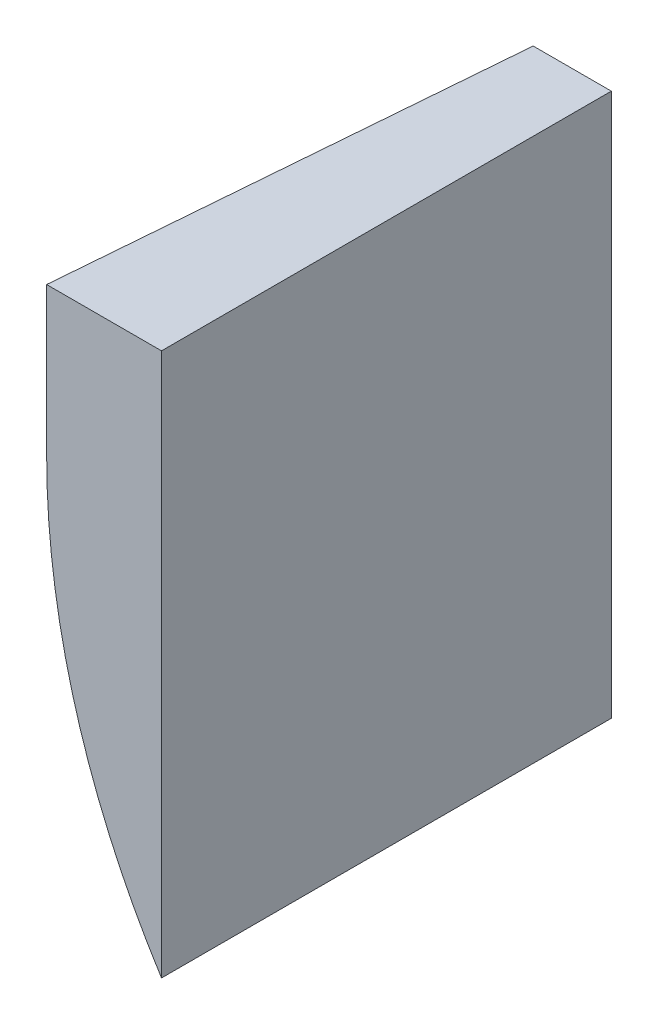
ISO-10303-21;
HEADER;
FILE_DESCRIPTION(('STEP AP214'),'2;1');
FILE_NAME('part.step','',(''),(''),'','','');
FILE_SCHEMA(('AUTOMOTIVE_DESIGN { 1 0 10303 214 1 1 1 1 }'));
ENDSEC;
DATA;
#1=APPLICATION_CONTEXT('core data for automotive mechanical design processes');
#2=APPLICATION_PROTOCOL_DEFINITION('international standard','automotive_design',2000,#1);
#3=PRODUCT_CONTEXT('',#1,'mechanical');
#4=PRODUCT('Part','Part','',(#3));
#5=PRODUCT_RELATED_PRODUCT_CATEGORY('part','',(#4));
#6=PRODUCT_DEFINITION_FORMATION('','',#4);
#7=PRODUCT_DEFINITION_CONTEXT('part definition',#1,'design');
#8=PRODUCT_DEFINITION('design','',#6,#7);
#9=PRODUCT_DEFINITION_SHAPE('','',#8);
#10=(LENGTH_UNIT() NAMED_UNIT(*) SI_UNIT(.MILLI.,.METRE.));
#11=(NAMED_UNIT(*) PLANE_ANGLE_UNIT() SI_UNIT($,.RADIAN.));
#12=(NAMED_UNIT(*) SI_UNIT($,.STERADIAN.) SOLID_ANGLE_UNIT());
#13=UNCERTAINTY_MEASURE_WITH_UNIT(LENGTH_MEASURE(1.E-05),#10,'distance_accuracy_value','');
#14=(GEOMETRIC_REPRESENTATION_CONTEXT(3) GLOBAL_UNCERTAINTY_ASSIGNED_CONTEXT((#13)) GLOBAL_UNIT_ASSIGNED_CONTEXT((#10,
#11,#12)) REPRESENTATION_CONTEXT('',''));
#15=CARTESIAN_POINT('',(0.,0.,0.));
#16=DIRECTION('',(0.,0.,1.));
#17=DIRECTION('',(1.,0.,0.));
#18=AXIS2_PLACEMENT_3D('',#15,#16,#17);
#19=CARTESIAN_POINT('',(47.7968750000637,14.7134363822883,0.));
#20=DIRECTION('',(0.,0.,-1.));
#21=DIRECTION('',(1.,0.,0.));
#22=AXIS2_PLACEMENT_3D('',#19,#20,#21);
#23=PLANE('',#22);
#24=DIRECTION('',(-1.,0.,0.));
#25=VECTOR('',#24,1.);
#26=CARTESIAN_POINT('',(-105.999999999999,45.7134363822695,0.));
#27=LINE('',#26,#25);
#28=CARTESIAN_POINT('',(-81.9999999999994,45.7134363822695,0.));
#29=VERTEX_POINT('',#28);
#30=CARTESIAN_POINT('',(-105.999999999999,45.7134363822695,0.));
#31=VERTEX_POINT('',#30);
#32=EDGE_CURVE('E228',#29,#31,#27,.T.);
#33=ORIENTED_EDGE('',*,*,#32,.T.);
#34=DIRECTION('',(0.,-1.,0.));
#35=VECTOR('',#34,1.);
#36=CARTESIAN_POINT('',(-105.999999999999,45.7134363822695,0.));
#37=LINE('',#36,#35);
#38=CARTESIAN_POINT('',(-106.,34.7134363822533,0.));
#39=VERTEX_POINT('',#38);
#40=EDGE_CURVE('E11',#31,#39,#37,.T.);
#41=ORIENTED_EDGE('',*,*,#40,.T.);
#42=DIRECTION('',(0.,-1.,0.));
#43=VECTOR('',#42,1.);
#44=CARTESIAN_POINT('',(-106.,34.7134363822533,0.));
#45=LINE('',#44,#43);
#46=CARTESIAN_POINT('',(-105.999999999999,14.7134363820908,0.));
#47=VERTEX_POINT('',#46);
#48=EDGE_CURVE('E51',#39,#47,#45,.T.);
#49=ORIENTED_EDGE('',*,*,#48,.T.);
#50=CARTESIAN_POINT('',(47.7968750000637,14.7134363822883,0.));
#51=DIRECTION('',(0.,0.,1.));
#52=DIRECTION('',(1.,0.,0.));
#53=AXIS2_PLACEMENT_3D('',#50,#51,#52);
#54=CIRCLE('',#53,153.796875000062);
#55=CARTESIAN_POINT('',(-81.9999999999997,-67.7865636177284,0.));
#56=VERTEX_POINT('',#55);
#57=EDGE_CURVE('E197',#47,#56,#54,.T.);
#58=ORIENTED_EDGE('',*,*,#57,.T.);
#59=DIRECTION('',(0.,1.,0.));
#60=VECTOR('',#59,1.);
#61=CARTESIAN_POINT('',(-81.9999999999994,-67.7865636177284,0.));
#62=LINE('',#61,#60);
#63=EDGE_CURVE('E207',#56,#29,#62,.T.);
#64=ORIENTED_EDGE('',*,*,#63,.T.);
#65=EDGE_LOOP('',(#33,#41,#49,#58,#64));
#66=FACE_BOUND('',#65,.T.);
#67=ADVANCED_FACE('F41',(#66),#23,.F.);
#68=CARTESIAN_POINT('',(300.506536228718,45.179601256023,-94.0000000000006));
#69=DIRECTION('',(0.,0.,1.));
#70=DIRECTION('',(-1.,0.,0.));
#71=AXIS2_PLACEMENT_3D('',#68,#69,#70);
#72=PLANE('',#71);
#73=DIRECTION('',(-1.41432303551508E-13,1.,0.));
#74=VECTOR('',#73,1.);
#75=CARTESIAN_POINT('',(-98.3321618335785,45.71343638227,-94.0000000000006));
#76=LINE('',#75,#74);
#77=CARTESIAN_POINT('',(-98.3319114364213,44.6340816674982,-94.0000000000006));
#78=VERTEX_POINT('',#77);
#79=CARTESIAN_POINT('',(-98.3321618335785,45.71343638227,-94.0000000000006));
#80=VERTEX_POINT('',#79);
#81=EDGE_CURVE('E89',#78,#80,#76,.T.);
#82=ORIENTED_EDGE('',*,*,#81,.T.);
#83=DIRECTION('',(1.,0.,0.));
#84=VECTOR('',#83,1.);
#85=CARTESIAN_POINT('',(-98.3321618335785,45.71343638227,-94.0000000000006));
#86=LINE('',#85,#84);
#87=CARTESIAN_POINT('',(-81.9999999999994,45.7134363822695,-94.0000000000006));
#88=VERTEX_POINT('',#87);
#89=EDGE_CURVE('E97',#80,#88,#86,.T.);
#90=ORIENTED_EDGE('',*,*,#89,.T.);
#91=DIRECTION('',(0.,-1.,0.));
#92=VECTOR('',#91,1.);
#93=CARTESIAN_POINT('',(-82.,-67.7865636177274,-94.0000000000006));
#94=LINE('',#93,#92);
#95=CARTESIAN_POINT('',(-81.9999999999999,-67.7865636177276,-94.0000000000006));
#96=VERTEX_POINT('',#95);
#97=EDGE_CURVE('E104',#88,#96,#94,.T.);
#98=ORIENTED_EDGE('',*,*,#97,.T.);
#99=CARTESIAN_POINT('',(300.506536228718,45.179601256023,-94.0000000000006));
#100=DIRECTION('',(0.,0.,-1.));
#101=DIRECTION('',(-1.,0.,0.));
#102=AXIS2_PLACEMENT_3D('',#99,#100,#101);
#103=CIRCLE('',#102,398.839071135182);
#104=EDGE_CURVE('E109',#96,#78,#103,.T.);
#105=ORIENTED_EDGE('',*,*,#104,.T.);
#106=EDGE_LOOP('',(#82,#90,#98,#105));
#107=FACE_BOUND('',#106,.T.);
#108=ADVANCED_FACE('F108',(#107),#72,.F.);
#109=CARTESIAN_POINT('',(-81.9999999999999,-67.7865636177276,-94.0000000000006));
#110=CARTESIAN_POINT('',(-81.9999999999997,-67.7865636177284,0.));
#111=CARTESIAN_POINT('',(-84.0711236804671,-60.773681964162,-94.0000000000006));
#112=CARTESIAN_POINT('',(-86.1126198645906,-61.3161974784924,0.));
#113=CARTESIAN_POINT('',(-87.9267134765562,-46.293835634991,-94.0000000000008));
#114=CARTESIAN_POINT('',(-93.1373067524633,-48.1432876357525,0.));
#115=CARTESIAN_POINT('',(-92.6056904083219,-23.5196888778718,-94.0000000000005));
#116=CARTESIAN_POINT('',(-100.532916292163,-27.7740118682492,0.));
#117=CARTESIAN_POINT('',(-95.9813194065896,-0.162766624292124,-94.0000000000008));
#118=CARTESIAN_POINT('',(-104.980143410612,-6.84462995870051,0.));
#119=CARTESIAN_POINT('',(-97.2954631422435,15.4190738093235,-94.0000000000006));
#120=CARTESIAN_POINT('',(-105.999999999998,7.4664886863727,0.));
#121=CARTESIAN_POINT('',(-97.8208055416148,24.9035648094025,-94.0000000000006));
#122=CARTESIAN_POINT('',(-105.999999999999,16.3896964591217,0.));
#123=CARTESIAN_POINT('',(-98.0059724944893,28.6875402124006,-94.0000000000007));
#124=CARTESIAN_POINT('',(-105.999999999999,19.5956487438722,0.));
#125=CARTESIAN_POINT('',(-98.2053123178462,34.5707414786269,-94.0000000000005));
#126=CARTESIAN_POINT('',(-106.,24.2921376494071,0.));
#127=CARTESIAN_POINT('',(-98.3098651271885,40.0141392667941,-94.0000000000006));
#128=CARTESIAN_POINT('',(-106.,29.1485146400913,0.));
#129=CARTESIAN_POINT('',(-98.3301578490081,43.1689347887702,-94.0000000000006));
#130=CARTESIAN_POINT('',(-106.,32.7039718525694,0.));
#131=CARTESIAN_POINT('',(-98.3321618335784,44.8432920042047,-94.0000000000006));
#132=CARTESIAN_POINT('',(-106.,35.0003707840781,0.));
#133=CARTESIAN_POINT('',(-98.3321618335783,44.7814249257853,-94.0000000000006));
#134=CARTESIAN_POINT('',(-106.,35.6933391744418,0.));
#135=CARTESIAN_POINT('',(-98.3321618335783,45.0143121639816,-94.0000000000007));
#136=CARTESIAN_POINT('',(-106.,37.0363681666248,0.));
#137=CARTESIAN_POINT('',(-98.3321618335785,45.0520659703652,-94.0000000000006));
#138=CARTESIAN_POINT('',(-106.,38.6292512119397,0.));
#139=CARTESIAN_POINT('',(-98.3321618335783,45.1824357757604,-94.0000000000006));
#140=CARTESIAN_POINT('',(-106.,40.3511322083065,0.));
#141=CARTESIAN_POINT('',(-98.3321618335786,45.2626403839126,-94.0000000000008));
#142=CARTESIAN_POINT('',(-106.,42.0811550536446,0.));
#143=CARTESIAN_POINT('',(-98.3321618335784,45.3517132842378,-94.0000000000004));
#144=CARTESIAN_POINT('',(-105.999999999999,43.382423727889,0.));
#145=CARTESIAN_POINT('',(-98.3321618335785,45.4326502533795,-94.0000000000008));
#146=CARTESIAN_POINT('',(-105.999999999999,44.250867306554,0.));
#147=CARTESIAN_POINT('',(-98.3321618335785,45.4774324950304,-94.0000000000006));
#148=CARTESIAN_POINT('',(-105.999999999999,44.8197267526223,0.));
#149=CARTESIAN_POINT('',(-98.3321618335785,45.5956957589785,-94.0000000000006));
#150=CARTESIAN_POINT('',(-105.999999999999,45.309925403195,0.));
#151=CARTESIAN_POINT('',(-98.3321618335785,45.5926789425148,-94.0000000000006));
#152=CARTESIAN_POINT('',(-105.999999999999,45.5868256015364,0.));
#153=CARTESIAN_POINT('',(-98.3321618335785,45.71343638227,-94.0000000000006));
#154=CARTESIAN_POINT('',(-105.999999999999,45.7134363822695,0.));
#155=B_SPLINE_SURFACE_WITH_KNOTS('',3,1,((#109,#110),(#111,#112),(#113,#114),(#115,#116),(#117,
#118),(#119,#120),(#121,#122),(#123,#124),(#125,#126),(#127,#128),(#129,#130),(#131,#132),(#133,
#134),(#135,#136),(#137,#138),(#139,#140),(#141,#142),(#143,#144),(#145,#146),(#147,#148),(#149,
#150),(#151,#152),(#153,#154)),.UNSPECIFIED.,.F.,.F.,.F.,(4,1,1,1,2,1,1,1,2,1,1,1,1,1,1,1,1,1,
4),(2,2),(0.,0.192698630525969,0.385397261051938,0.578095891577907,0.770794522103876,
0.815366807056278,0.85993909200868,0.904511376961081,0.949083661913483,0.955448204174298,
0.961812746435112,0.968177288695927,0.974541830956742,0.980906373217556,0.987270915478371,
0.990453186608778,0.993635457739185,0.996817728869593,1.),(0.,1.),.UNSPECIFIED.);
#156=DIRECTION('',(0.,0.,-1.));
#157=VECTOR('',#156,1.);
#158=CARTESIAN_POINT('',(-81.9999999999998,-67.786563617728,-47.0000000000003));
#159=LINE('',#158,#157);
#160=EDGE_CURVE('E94',#56,#96,#159,.T.);
#161=DIRECTION('',(-0.0813026962798846,0.,0.996689455937816));
#162=VECTOR('',#161,1.);
#163=CARTESIAN_POINT('',(-102.166080916789,45.7134363822698,-47.0000000000003));
#164=LINE('',#163,#162);
#165=EDGE_CURVE('E66',#80,#31,#164,.T.);
#166=ORIENTED_EDGE('',*,*,#104,.F.);
#167=ORIENTED_EDGE('',*,*,#160,.F.);
#168=ORIENTED_EDGE('',*,*,#57,.F.);
#169=ORIENTED_EDGE('',*,*,#48,.F.);
#170=ORIENTED_EDGE('',*,*,#40,.F.);
#171=ORIENTED_EDGE('',*,*,#165,.F.);
#172=ORIENTED_EDGE('',*,*,#81,.F.);
#173=EDGE_LOOP('',(#166,#167,#168,#169,#170,#171,#172));
#174=FACE_BOUND('',#173,.T.);
#175=ADVANCED_FACE('F87',(#174),#155,.F.);
#176=CARTESIAN_POINT('',(-98.3321618335785,45.71343638227,-94.0000000000006));
#177=DIRECTION('',(0.,1.,0.));
#178=DIRECTION('',(1.,0.,0.));
#179=AXIS2_PLACEMENT_3D('',#176,#177,#178);
#180=PLANE('',#179);
#181=ORIENTED_EDGE('',*,*,#89,.F.);
#182=ORIENTED_EDGE('',*,*,#165,.T.);
#183=ORIENTED_EDGE('',*,*,#32,.F.);
#184=DIRECTION('',(0.,0.,1.));
#185=VECTOR('',#184,1.);
#186=CARTESIAN_POINT('',(-81.9999999999994,45.7134363822695,-47.0000000000003));
#187=LINE('',#186,#185);
#188=EDGE_CURVE('E93',#88,#29,#187,.T.);
#189=ORIENTED_EDGE('',*,*,#188,.F.);
#190=EDGE_LOOP('',(#181,#182,#183,#189));
#191=FACE_BOUND('',#190,.T.);
#192=ADVANCED_FACE('F99',(#191),#180,.T.);
#193=CARTESIAN_POINT('',(-81.9999999999994,45.7134363822695,-94.0000000000006));
#194=DIRECTION('',(1.,0.,0.));
#195=DIRECTION('',(0.,-1.,0.));
#196=AXIS2_PLACEMENT_3D('',#193,#194,#195);
#197=PLANE('',#196);
#198=ORIENTED_EDGE('',*,*,#97,.F.);
#199=ORIENTED_EDGE('',*,*,#188,.T.);
#200=ORIENTED_EDGE('',*,*,#63,.F.);
#201=ORIENTED_EDGE('',*,*,#160,.T.);
#202=EDGE_LOOP('',(#198,#199,#200,#201));
#203=FACE_BOUND('',#202,.T.);
#204=ADVANCED_FACE('F164',(#203),#197,.T.);
#205=CLOSED_SHELL('',(#67,#108,#175,#192,#204));
#206=MANIFOLD_SOLID_BREP('B2',#205);
#207=ADVANCED_BREP_SHAPE_REPRESENTATION('',(#18,#206),#14);
#208=SHAPE_DEFINITION_REPRESENTATION(#9,#207);
ENDSEC;
END-ISO-10303-21;
